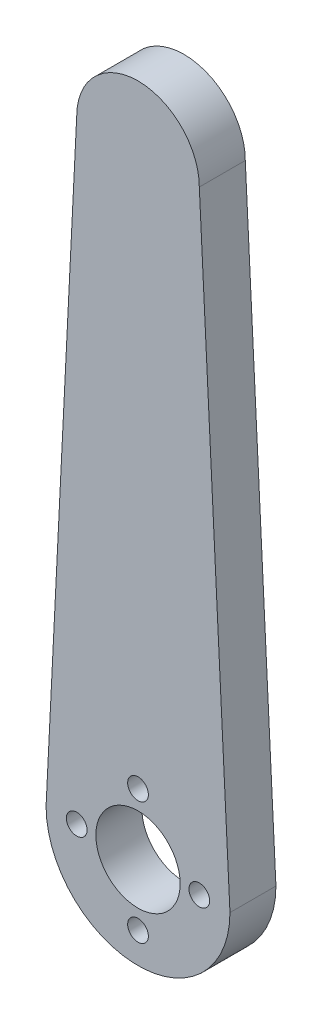
ISO-10303-21;
HEADER;
FILE_DESCRIPTION(('STEP AP214'),'2;1');
FILE_NAME('part.step','',(''),(''),'','','');
FILE_SCHEMA(('AUTOMOTIVE_DESIGN { 1 0 10303 214 1 1 1 1 }'));
ENDSEC;
DATA;
#1=APPLICATION_CONTEXT('core data for automotive mechanical design processes');
#2=APPLICATION_PROTOCOL_DEFINITION('international standard','automotive_design',2000,#1);
#3=PRODUCT_CONTEXT('',#1,'mechanical');
#4=PRODUCT('Part','Part','',(#3));
#5=PRODUCT_RELATED_PRODUCT_CATEGORY('part','',(#4));
#6=PRODUCT_DEFINITION_FORMATION('','',#4);
#7=PRODUCT_DEFINITION_CONTEXT('part definition',#1,'design');
#8=PRODUCT_DEFINITION('design','',#6,#7);
#9=PRODUCT_DEFINITION_SHAPE('','',#8);
#10=(LENGTH_UNIT() NAMED_UNIT(*) SI_UNIT(.MILLI.,.METRE.));
#11=(NAMED_UNIT(*) PLANE_ANGLE_UNIT() SI_UNIT($,.RADIAN.));
#12=(NAMED_UNIT(*) SI_UNIT($,.STERADIAN.) SOLID_ANGLE_UNIT());
#13=UNCERTAINTY_MEASURE_WITH_UNIT(LENGTH_MEASURE(1.E-05),#10,'distance_accuracy_value','');
#14=(GEOMETRIC_REPRESENTATION_CONTEXT(3) GLOBAL_UNCERTAINTY_ASSIGNED_CONTEXT((#13)) GLOBAL_UNIT_ASSIGNED_CONTEXT((#10,
#11,#12)) REPRESENTATION_CONTEXT('',''));
#15=CARTESIAN_POINT('',(0.,0.,0.));
#16=DIRECTION('',(0.,0.,1.));
#17=DIRECTION('',(1.,0.,0.));
#18=AXIS2_PLACEMENT_3D('',#15,#16,#17);
#19=CARTESIAN_POINT('',(0.,0.,6.));
#20=DIRECTION('',(0.,0.,-1.));
#21=DIRECTION('',(-1.,0.,0.));
#22=AXIS2_PLACEMENT_3D('',#19,#20,#21);
#23=CYLINDRICAL_SURFACE('',#22,12.);
#24=CARTESIAN_POINT('',(0.,0.,0.));
#25=DIRECTION('',(0.,0.,1.));
#26=DIRECTION('',(-1.,0.,0.));
#27=AXIS2_PLACEMENT_3D('',#24,#25,#26);
#28=CIRCLE('',#27,12.);
#29=CARTESIAN_POINT('',(-12.,0.,0.));
#30=VERTEX_POINT('',#29);
#31=CARTESIAN_POINT('',(12.,0.,0.));
#32=VERTEX_POINT('',#31);
#33=EDGE_CURVE('E95',#30,#32,#28,.T.);
#34=ORIENTED_EDGE('',*,*,#33,.T.);
#35=DIRECTION('',(0.,0.,-1.));
#36=VECTOR('',#35,1.);
#37=CARTESIAN_POINT('',(12.,0.,6.));
#38=LINE('',#37,#36);
#39=CARTESIAN_POINT('',(12.,0.,6.));
#40=VERTEX_POINT('',#39);
#41=EDGE_CURVE('E11',#40,#32,#38,.T.);
#42=ORIENTED_EDGE('',*,*,#41,.F.);
#43=CARTESIAN_POINT('',(0.,0.,6.));
#44=DIRECTION('',(0.,0.,1.));
#45=DIRECTION('',(-1.,0.,0.));
#46=AXIS2_PLACEMENT_3D('',#43,#44,#45);
#47=CIRCLE('',#46,12.);
#48=CARTESIAN_POINT('',(-12.,0.,6.));
#49=VERTEX_POINT('',#48);
#50=EDGE_CURVE('E83',#49,#40,#47,.T.);
#51=ORIENTED_EDGE('',*,*,#50,.F.);
#52=DIRECTION('',(0.,0.,-1.));
#53=VECTOR('',#52,1.);
#54=CARTESIAN_POINT('',(-12.,0.,6.));
#55=LINE('',#54,#53);
#56=EDGE_CURVE('E91',#49,#30,#55,.T.);
#57=ORIENTED_EDGE('',*,*,#56,.T.);
#58=EDGE_LOOP('',(#34,#42,#51,#57));
#59=FACE_BOUND('',#58,.T.);
#60=ADVANCED_FACE('F32',(#59),#23,.T.);
#61=CARTESIAN_POINT('',(12.,0.,6.));
#62=DIRECTION('',(-0.998752338877845,-0.0499376169438922,0.));
#63=DIRECTION('',(0.0499376169438922,-0.998752338877845,0.));
#64=AXIS2_PLACEMENT_3D('',#61,#62,#63);
#65=PLANE('',#64);
#66=DIRECTION('',(-0.0499376169438922,0.998752338877845,0.));
#67=VECTOR('',#66,1.);
#68=CARTESIAN_POINT('',(12.,0.,0.));
#69=LINE('',#68,#67);
#70=CARTESIAN_POINT('',(8.,80.,0.));
#71=VERTEX_POINT('',#70);
#72=EDGE_CURVE('E87',#32,#71,#69,.T.);
#73=ORIENTED_EDGE('',*,*,#72,.T.);
#74=DIRECTION('',(0.,0.,-1.));
#75=VECTOR('',#74,1.);
#76=CARTESIAN_POINT('',(8.,80.,6.));
#77=LINE('',#76,#75);
#78=CARTESIAN_POINT('',(8.,80.,6.));
#79=VERTEX_POINT('',#78);
#80=EDGE_CURVE('E40',#79,#71,#77,.T.);
#81=ORIENTED_EDGE('',*,*,#80,.F.);
#82=DIRECTION('',(-0.0499376169438922,0.998752338877845,0.));
#83=VECTOR('',#82,1.);
#84=CARTESIAN_POINT('',(12.,0.,6.));
#85=LINE('',#84,#83);
#86=EDGE_CURVE('E78',#40,#79,#85,.T.);
#87=ORIENTED_EDGE('',*,*,#86,.F.);
#88=ORIENTED_EDGE('',*,*,#41,.T.);
#89=EDGE_LOOP('',(#73,#81,#87,#88));
#90=FACE_BOUND('',#89,.T.);
#91=ADVANCED_FACE('F86',(#90),#65,.F.);
#92=CARTESIAN_POINT('',(0.,80.,6.));
#93=DIRECTION('',(0.,0.,-1.));
#94=DIRECTION('',(-1.,0.,0.));
#95=AXIS2_PLACEMENT_3D('',#92,#93,#94);
#96=CYLINDRICAL_SURFACE('',#95,8.);
#97=CARTESIAN_POINT('',(0.,80.,0.));
#98=DIRECTION('',(0.,0.,1.));
#99=DIRECTION('',(1.,0.,0.));
#100=AXIS2_PLACEMENT_3D('',#97,#98,#99);
#101=CIRCLE('',#100,8.);
#102=CARTESIAN_POINT('',(-8.,80.,0.));
#103=VERTEX_POINT('',#102);
#104=EDGE_CURVE('E65',#71,#103,#101,.T.);
#105=ORIENTED_EDGE('',*,*,#104,.T.);
#106=DIRECTION('',(0.,0.,-1.));
#107=VECTOR('',#106,1.);
#108=CARTESIAN_POINT('',(-8.,80.,6.));
#109=LINE('',#108,#107);
#110=CARTESIAN_POINT('',(-8.,80.,6.));
#111=VERTEX_POINT('',#110);
#112=EDGE_CURVE('E88',#111,#103,#109,.T.);
#113=ORIENTED_EDGE('',*,*,#112,.F.);
#114=CARTESIAN_POINT('',(0.,80.,6.));
#115=DIRECTION('',(0.,0.,1.));
#116=DIRECTION('',(1.,0.,0.));
#117=AXIS2_PLACEMENT_3D('',#114,#115,#116);
#118=CIRCLE('',#117,8.);
#119=EDGE_CURVE('E81',#79,#111,#118,.T.);
#120=ORIENTED_EDGE('',*,*,#119,.F.);
#121=ORIENTED_EDGE('',*,*,#80,.T.);
#122=EDGE_LOOP('',(#105,#113,#120,#121));
#123=FACE_BOUND('',#122,.T.);
#124=ADVANCED_FACE('F89',(#123),#96,.T.);
#125=CARTESIAN_POINT('',(-12.,0.,6.));
#126=DIRECTION('',(0.998752338877845,-0.0499376169438922,0.));
#127=DIRECTION('',(0.0499376169438922,0.998752338877845,0.));
#128=AXIS2_PLACEMENT_3D('',#125,#126,#127);
#129=PLANE('',#128);
#130=DIRECTION('',(-0.0499376169438922,-0.998752338877845,0.));
#131=VECTOR('',#130,1.);
#132=CARTESIAN_POINT('',(-12.,0.,0.));
#133=LINE('',#132,#131);
#134=EDGE_CURVE('E71',#103,#30,#133,.T.);
#135=ORIENTED_EDGE('',*,*,#134,.T.);
#136=ORIENTED_EDGE('',*,*,#56,.F.);
#137=DIRECTION('',(-0.0499376169438922,-0.998752338877845,0.));
#138=VECTOR('',#137,1.);
#139=CARTESIAN_POINT('',(-12.,0.,6.));
#140=LINE('',#139,#138);
#141=EDGE_CURVE('E48',#111,#49,#140,.T.);
#142=ORIENTED_EDGE('',*,*,#141,.F.);
#143=ORIENTED_EDGE('',*,*,#112,.T.);
#144=EDGE_LOOP('',(#135,#136,#142,#143));
#145=FACE_BOUND('',#144,.T.);
#146=ADVANCED_FACE('F103',(#145),#129,.F.);
#147=CARTESIAN_POINT('',(0.,0.,6.));
#148=DIRECTION('',(0.,0.,-1.));
#149=DIRECTION('',(-1.,0.,0.));
#150=AXIS2_PLACEMENT_3D('',#147,#148,#149);
#151=PLANE('',#150);
#152=CARTESIAN_POINT('',(0.,8.,6.));
#153=DIRECTION('',(0.,0.,-1.));
#154=DIRECTION('',(-1.,0.,0.));
#155=AXIS2_PLACEMENT_3D('',#152,#153,#154);
#156=CIRCLE('',#155,1.35);
#157=CARTESIAN_POINT('',(-1.35,8.,6.));
#158=VERTEX_POINT('',#157);
#159=EDGE_CURVE('E114',#158,#158,#156,.T.);
#160=ORIENTED_EDGE('',*,*,#159,.T.);
#161=EDGE_LOOP('',(#160));
#162=FACE_BOUND('',#161,.T.);
#163=CARTESIAN_POINT('',(-8.,0.,6.));
#164=DIRECTION('',(0.,0.,-1.));
#165=DIRECTION('',(-1.,0.,0.));
#166=AXIS2_PLACEMENT_3D('',#163,#164,#165);
#167=CIRCLE('',#166,1.35);
#168=CARTESIAN_POINT('',(-9.35,0.,6.));
#169=VERTEX_POINT('',#168);
#170=EDGE_CURVE('E117',#169,#169,#167,.T.);
#171=ORIENTED_EDGE('',*,*,#170,.T.);
#172=EDGE_LOOP('',(#171));
#173=FACE_BOUND('',#172,.T.);
#174=CARTESIAN_POINT('',(0.,-8.,6.));
#175=DIRECTION('',(0.,0.,-1.));
#176=DIRECTION('',(-1.,0.,0.));
#177=AXIS2_PLACEMENT_3D('',#174,#175,#176);
#178=CIRCLE('',#177,1.35);
#179=CARTESIAN_POINT('',(-1.35,-8.,6.));
#180=VERTEX_POINT('',#179);
#181=EDGE_CURVE('E120',#180,#180,#178,.T.);
#182=ORIENTED_EDGE('',*,*,#181,.T.);
#183=EDGE_LOOP('',(#182));
#184=FACE_BOUND('',#183,.T.);
#185=CARTESIAN_POINT('',(8.,0.,6.));
#186=DIRECTION('',(0.,0.,-1.));
#187=DIRECTION('',(-1.,0.,0.));
#188=AXIS2_PLACEMENT_3D('',#185,#186,#187);
#189=CIRCLE('',#188,1.35);
#190=CARTESIAN_POINT('',(6.65,0.,6.));
#191=VERTEX_POINT('',#190);
#192=EDGE_CURVE('E123',#191,#191,#189,.T.);
#193=ORIENTED_EDGE('',*,*,#192,.T.);
#194=EDGE_LOOP('',(#193));
#195=FACE_BOUND('',#194,.T.);
#196=CARTESIAN_POINT('',(0.,0.,6.));
#197=DIRECTION('',(0.,0.,-1.));
#198=DIRECTION('',(-1.,0.,0.));
#199=AXIS2_PLACEMENT_3D('',#196,#197,#198);
#200=CIRCLE('',#199,5.5);
#201=CARTESIAN_POINT('',(-5.5,0.,6.));
#202=VERTEX_POINT('',#201);
#203=EDGE_CURVE('E98',#202,#202,#200,.T.);
#204=ORIENTED_EDGE('',*,*,#203,.T.);
#205=EDGE_LOOP('',(#204));
#206=FACE_BOUND('',#205,.T.);
#207=ORIENTED_EDGE('',*,*,#50,.T.);
#208=ORIENTED_EDGE('',*,*,#86,.T.);
#209=ORIENTED_EDGE('',*,*,#119,.T.);
#210=ORIENTED_EDGE('',*,*,#141,.T.);
#211=EDGE_LOOP('',(#207,#208,#209,#210));
#212=FACE_BOUND('',#211,.T.);
#213=ADVANCED_FACE('F79',(#162,#173,#184,#195,#206,#212),#151,.F.);
#214=CARTESIAN_POINT('',(0.,0.,0.));
#215=DIRECTION('',(0.,0.,-1.));
#216=DIRECTION('',(-1.,0.,0.));
#217=AXIS2_PLACEMENT_3D('',#214,#215,#216);
#218=PLANE('',#217);
#219=CARTESIAN_POINT('',(0.,8.,0.));
#220=DIRECTION('',(0.,0.,1.));
#221=DIRECTION('',(1.,0.,0.));
#222=AXIS2_PLACEMENT_3D('',#219,#220,#221);
#223=CIRCLE('',#222,1.35);
#224=CARTESIAN_POINT('',(1.35,8.,0.));
#225=VERTEX_POINT('',#224);
#226=EDGE_CURVE('E133',#225,#225,#223,.T.);
#227=ORIENTED_EDGE('',*,*,#226,.T.);
#228=EDGE_LOOP('',(#227));
#229=FACE_BOUND('',#228,.T.);
#230=CARTESIAN_POINT('',(-8.,0.,0.));
#231=DIRECTION('',(0.,0.,1.));
#232=DIRECTION('',(1.,0.,0.));
#233=AXIS2_PLACEMENT_3D('',#230,#231,#232);
#234=CIRCLE('',#233,1.35);
#235=CARTESIAN_POINT('',(-6.65,0.,0.));
#236=VERTEX_POINT('',#235);
#237=EDGE_CURVE('E130',#236,#236,#234,.T.);
#238=ORIENTED_EDGE('',*,*,#237,.T.);
#239=EDGE_LOOP('',(#238));
#240=FACE_BOUND('',#239,.T.);
#241=CARTESIAN_POINT('',(0.,-8.,0.));
#242=DIRECTION('',(0.,0.,1.));
#243=DIRECTION('',(1.,0.,0.));
#244=AXIS2_PLACEMENT_3D('',#241,#242,#243);
#245=CIRCLE('',#244,1.35);
#246=CARTESIAN_POINT('',(1.35,-8.,0.));
#247=VERTEX_POINT('',#246);
#248=EDGE_CURVE('E127',#247,#247,#245,.T.);
#249=ORIENTED_EDGE('',*,*,#248,.T.);
#250=EDGE_LOOP('',(#249));
#251=FACE_BOUND('',#250,.T.);
#252=CARTESIAN_POINT('',(8.,0.,0.));
#253=DIRECTION('',(0.,0.,1.));
#254=DIRECTION('',(1.,0.,0.));
#255=AXIS2_PLACEMENT_3D('',#252,#253,#254);
#256=CIRCLE('',#255,1.35);
#257=CARTESIAN_POINT('',(9.35,0.,0.));
#258=VERTEX_POINT('',#257);
#259=EDGE_CURVE('E126',#258,#258,#256,.T.);
#260=ORIENTED_EDGE('',*,*,#259,.T.);
#261=EDGE_LOOP('',(#260));
#262=FACE_BOUND('',#261,.T.);
#263=CARTESIAN_POINT('',(0.,0.,0.));
#264=DIRECTION('',(0.,0.,1.));
#265=DIRECTION('',(1.,0.,0.));
#266=AXIS2_PLACEMENT_3D('',#263,#264,#265);
#267=CIRCLE('',#266,5.5);
#268=CARTESIAN_POINT('',(5.5,0.,0.));
#269=VERTEX_POINT('',#268);
#270=EDGE_CURVE('E111',#269,#269,#267,.T.);
#271=ORIENTED_EDGE('',*,*,#270,.T.);
#272=EDGE_LOOP('',(#271));
#273=FACE_BOUND('',#272,.T.);
#274=ORIENTED_EDGE('',*,*,#33,.F.);
#275=ORIENTED_EDGE('',*,*,#134,.F.);
#276=ORIENTED_EDGE('',*,*,#104,.F.);
#277=ORIENTED_EDGE('',*,*,#72,.F.);
#278=EDGE_LOOP('',(#274,#275,#276,#277));
#279=FACE_BOUND('',#278,.T.);
#280=ADVANCED_FACE('F106',(#229,#240,#251,#262,#273,#279),#218,.T.);
#281=CARTESIAN_POINT('',(0.,0.,0.));
#282=DIRECTION('',(0.,0.,1.));
#283=DIRECTION('',(1.,0.,0.));
#284=AXIS2_PLACEMENT_3D('',#281,#282,#283);
#285=CYLINDRICAL_SURFACE('',#284,5.5);
#286=ORIENTED_EDGE('',*,*,#270,.F.);
#287=EDGE_LOOP('',(#286));
#288=FACE_BOUND('',#287,.T.);
#289=ORIENTED_EDGE('',*,*,#203,.F.);
#290=EDGE_LOOP('',(#289));
#291=FACE_BOUND('',#290,.T.);
#292=ADVANCED_FACE('F159',(#288,#291),#285,.F.);
#293=CARTESIAN_POINT('',(8.,0.,0.));
#294=DIRECTION('',(0.,0.,1.));
#295=DIRECTION('',(1.,0.,0.));
#296=AXIS2_PLACEMENT_3D('',#293,#294,#295);
#297=CYLINDRICAL_SURFACE('',#296,1.35);
#298=ORIENTED_EDGE('',*,*,#259,.F.);
#299=EDGE_LOOP('',(#298));
#300=FACE_BOUND('',#299,.T.);
#301=ORIENTED_EDGE('',*,*,#192,.F.);
#302=EDGE_LOOP('',(#301));
#303=FACE_BOUND('',#302,.T.);
#304=ADVANCED_FACE('F161',(#300,#303),#297,.F.);
#305=CARTESIAN_POINT('',(0.,-8.,0.));
#306=DIRECTION('',(0.,0.,1.));
#307=DIRECTION('',(1.,0.,0.));
#308=AXIS2_PLACEMENT_3D('',#305,#306,#307);
#309=CYLINDRICAL_SURFACE('',#308,1.35);
#310=ORIENTED_EDGE('',*,*,#248,.F.);
#311=EDGE_LOOP('',(#310));
#312=FACE_BOUND('',#311,.T.);
#313=ORIENTED_EDGE('',*,*,#181,.F.);
#314=EDGE_LOOP('',(#313));
#315=FACE_BOUND('',#314,.T.);
#316=ADVANCED_FACE('F145',(#312,#315),#309,.F.);
#317=CARTESIAN_POINT('',(-8.,0.,0.));
#318=DIRECTION('',(0.,0.,1.));
#319=DIRECTION('',(1.,0.,0.));
#320=AXIS2_PLACEMENT_3D('',#317,#318,#319);
#321=CYLINDRICAL_SURFACE('',#320,1.35);
#322=ORIENTED_EDGE('',*,*,#237,.F.);
#323=EDGE_LOOP('',(#322));
#324=FACE_BOUND('',#323,.T.);
#325=ORIENTED_EDGE('',*,*,#170,.F.);
#326=EDGE_LOOP('',(#325));
#327=FACE_BOUND('',#326,.T.);
#328=ADVANCED_FACE('F141',(#324,#327),#321,.F.);
#329=CARTESIAN_POINT('',(0.,8.,0.));
#330=DIRECTION('',(0.,0.,1.));
#331=DIRECTION('',(1.,0.,0.));
#332=AXIS2_PLACEMENT_3D('',#329,#330,#331);
#333=CYLINDRICAL_SURFACE('',#332,1.35);
#334=ORIENTED_EDGE('',*,*,#226,.F.);
#335=EDGE_LOOP('',(#334));
#336=FACE_BOUND('',#335,.T.);
#337=ORIENTED_EDGE('',*,*,#159,.F.);
#338=EDGE_LOOP('',(#337));
#339=FACE_BOUND('',#338,.T.);
#340=ADVANCED_FACE('F144',(#336,#339),#333,.F.);
#341=CLOSED_SHELL('',(#60,#91,#124,#146,#213,#280,#292,#304,#316,#328,#340));
#342=MANIFOLD_SOLID_BREP('B2',#341);
#343=ADVANCED_BREP_SHAPE_REPRESENTATION('',(#18,#342),#14);
#344=SHAPE_DEFINITION_REPRESENTATION(#9,#343);
ENDSEC;
END-ISO-10303-21;
